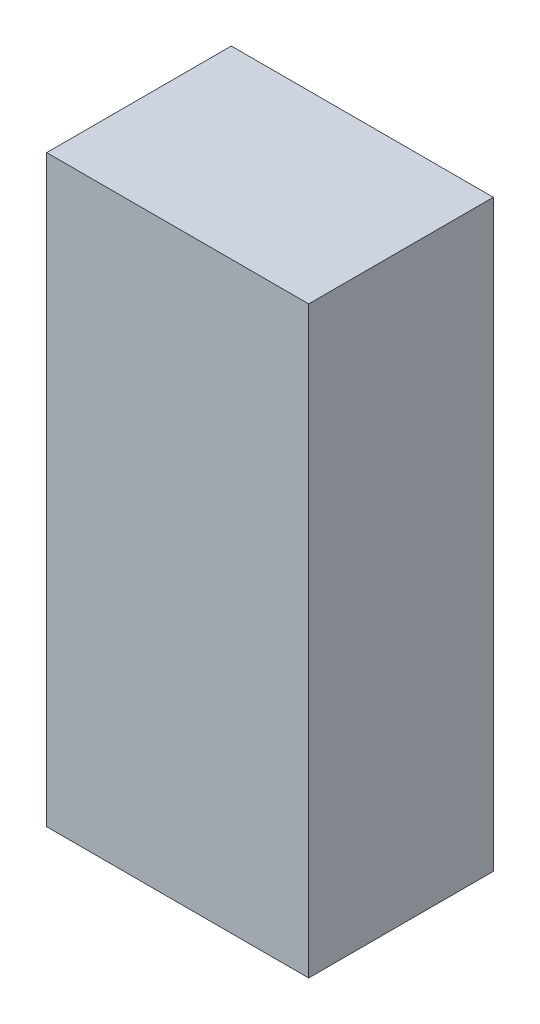
ISO-10303-21;
HEADER;
FILE_DESCRIPTION(('STEP AP214'),'2;1');
FILE_NAME('part.step','',(''),(''),'','','');
FILE_SCHEMA(('AUTOMOTIVE_DESIGN { 1 0 10303 214 1 1 1 1 }'));
ENDSEC;
DATA;
#1=APPLICATION_CONTEXT('core data for automotive mechanical design processes');
#2=APPLICATION_PROTOCOL_DEFINITION('international standard','automotive_design',2000,#1);
#3=PRODUCT_CONTEXT('',#1,'mechanical');
#4=PRODUCT('Part','Part','',(#3));
#5=PRODUCT_RELATED_PRODUCT_CATEGORY('part','',(#4));
#6=PRODUCT_DEFINITION_FORMATION('','',#4);
#7=PRODUCT_DEFINITION_CONTEXT('part definition',#1,'design');
#8=PRODUCT_DEFINITION('design','',#6,#7);
#9=PRODUCT_DEFINITION_SHAPE('','',#8);
#10=(LENGTH_UNIT() NAMED_UNIT(*) SI_UNIT(.MILLI.,.METRE.));
#11=(NAMED_UNIT(*) PLANE_ANGLE_UNIT() SI_UNIT($,.RADIAN.));
#12=(NAMED_UNIT(*) SI_UNIT($,.STERADIAN.) SOLID_ANGLE_UNIT());
#13=UNCERTAINTY_MEASURE_WITH_UNIT(LENGTH_MEASURE(1.E-05),#10,'distance_accuracy_value','');
#14=(GEOMETRIC_REPRESENTATION_CONTEXT(3) GLOBAL_UNCERTAINTY_ASSIGNED_CONTEXT((#13)) GLOBAL_UNIT_ASSIGNED_CONTEXT((#10,
#11,#12)) REPRESENTATION_CONTEXT('',''));
#15=CARTESIAN_POINT('',(0.,0.,0.));
#16=DIRECTION('',(0.,0.,1.));
#17=DIRECTION('',(1.,0.,0.));
#18=AXIS2_PLACEMENT_3D('',#15,#16,#17);
#19=CARTESIAN_POINT('',(0.92000832,-2.05000352,1.29679954));
#20=DIRECTION('',(0.,0.,-1.));
#21=DIRECTION('',(0.,-1.,0.));
#22=AXIS2_PLACEMENT_3D('',#19,#20,#21);
#23=PLANE('',#22);
#24=DIRECTION('',(1.67268005458418E-05,0.999999999860107,0.));
#25=VECTOR('',#24,1.);
#26=CARTESIAN_POINT('',(0.92000832,-2.05000352,1.29679954));
#27=LINE('',#26,#25);
#28=CARTESIAN_POINT('',(0.92000832,-2.05000352,1.29679954));
#29=VERTEX_POINT('',#28);
#30=CARTESIAN_POINT('',(0.9200769,2.05000352,1.29679954));
#31=VERTEX_POINT('',#30);
#32=EDGE_CURVE('E97',#29,#31,#27,.T.);
#33=ORIENTED_EDGE('',*,*,#32,.T.);
#34=DIRECTION('',(-1.,0.,0.));
#35=VECTOR('',#34,1.);
#36=CARTESIAN_POINT('',(0.9200769,2.05000352,1.29679954));
#37=LINE('',#36,#35);
#38=CARTESIAN_POINT('',(-0.92007436,2.05000352,1.29679954));
#39=VERTEX_POINT('',#38);
#40=EDGE_CURVE('E69',#31,#39,#37,.T.);
#41=ORIENTED_EDGE('',*,*,#40,.T.);
#42=DIRECTION('',(0.,-1.,0.));
#43=VECTOR('',#42,1.);
#44=CARTESIAN_POINT('',(-0.92007436,2.05000352,1.29679954));
#45=LINE('',#44,#43);
#46=CARTESIAN_POINT('',(-0.92007436,-2.04997558,1.29679954));
#47=VERTEX_POINT('',#46);
#48=EDGE_CURVE('E84',#39,#47,#45,.T.);
#49=ORIENTED_EDGE('',*,*,#48,.T.);
#50=DIRECTION('',(0.999999999884722,-1.51841003101958E-05,0.));
#51=VECTOR('',#50,1.);
#52=CARTESIAN_POINT('',(-0.92007436,-2.04997558,1.29679954));
#53=LINE('',#52,#51);
#54=EDGE_CURVE('E11',#47,#29,#53,.T.);
#55=ORIENTED_EDGE('',*,*,#54,.T.);
#56=EDGE_LOOP('',(#33,#41,#49,#55));
#57=FACE_BOUND('',#56,.T.);
#58=ADVANCED_FACE('F17',(#57),#23,.F.);
#59=CARTESIAN_POINT('',(0.92000832,-2.05000352,0.));
#60=DIRECTION('',(0.,0.,-1.));
#61=DIRECTION('',(0.,-1.,0.));
#62=AXIS2_PLACEMENT_3D('',#59,#60,#61);
#63=PLANE('',#62);
#64=DIRECTION('',(1.67268005458418E-05,0.999999999860107,0.));
#65=VECTOR('',#64,1.);
#66=CARTESIAN_POINT('',(0.92000832,-2.05000352,0.));
#67=LINE('',#66,#65);
#68=CARTESIAN_POINT('',(0.92000832,-2.05000352,0.));
#69=VERTEX_POINT('',#68);
#70=CARTESIAN_POINT('',(0.9200769,2.05000352,0.));
#71=VERTEX_POINT('',#70);
#72=EDGE_CURVE('E87',#69,#71,#67,.T.);
#73=ORIENTED_EDGE('',*,*,#72,.F.);
#74=DIRECTION('',(0.999999999884722,-1.51841003101958E-05,0.));
#75=VECTOR('',#74,1.);
#76=CARTESIAN_POINT('',(-0.92007436,-2.04997558,0.));
#77=LINE('',#76,#75);
#78=CARTESIAN_POINT('',(-0.92007436,-2.04997558,0.));
#79=VERTEX_POINT('',#78);
#80=EDGE_CURVE('E27',#79,#69,#77,.T.);
#81=ORIENTED_EDGE('',*,*,#80,.F.);
#82=DIRECTION('',(0.,-1.,0.));
#83=VECTOR('',#82,1.);
#84=CARTESIAN_POINT('',(-0.92007436,2.05000352,0.));
#85=LINE('',#84,#83);
#86=CARTESIAN_POINT('',(-0.92007436,2.05000352,0.));
#87=VERTEX_POINT('',#86);
#88=EDGE_CURVE('E56',#87,#79,#85,.T.);
#89=ORIENTED_EDGE('',*,*,#88,.F.);
#90=DIRECTION('',(-1.,0.,0.));
#91=VECTOR('',#90,1.);
#92=CARTESIAN_POINT('',(0.9200769,2.05000352,0.));
#93=LINE('',#92,#91);
#94=EDGE_CURVE('E90',#71,#87,#93,.T.);
#95=ORIENTED_EDGE('',*,*,#94,.F.);
#96=EDGE_LOOP('',(#73,#81,#89,#95));
#97=FACE_BOUND('',#96,.T.);
#98=ADVANCED_FACE('F88',(#97),#63,.T.);
#99=CARTESIAN_POINT('',(-0.92007436,-2.04997558,0.));
#100=DIRECTION('',(1.51841003101958E-05,0.999999999884722,0.));
#101=DIRECTION('',(0.,0.,-1.));
#102=AXIS2_PLACEMENT_3D('',#99,#100,#101);
#103=PLANE('',#102);
#104=DIRECTION('',(0.,0.,1.));
#105=VECTOR('',#104,1.);
#106=CARTESIAN_POINT('',(-0.92007436,-2.04997558,0.));
#107=LINE('',#106,#105);
#108=EDGE_CURVE('E20',#79,#47,#107,.T.);
#109=ORIENTED_EDGE('',*,*,#108,.F.);
#110=ORIENTED_EDGE('',*,*,#80,.T.);
#111=DIRECTION('',(0.,0.,1.));
#112=VECTOR('',#111,1.);
#113=CARTESIAN_POINT('',(0.92000832,-2.05000352,0.));
#114=LINE('',#113,#112);
#115=EDGE_CURVE('E81',#69,#29,#114,.T.);
#116=ORIENTED_EDGE('',*,*,#115,.T.);
#117=ORIENTED_EDGE('',*,*,#54,.F.);
#118=EDGE_LOOP('',(#109,#110,#116,#117));
#119=FACE_BOUND('',#118,.T.);
#120=ADVANCED_FACE('F79',(#119),#103,.F.);
#121=CARTESIAN_POINT('',(-0.92007436,2.05000352,0.));
#122=DIRECTION('',(1.,0.,0.));
#123=DIRECTION('',(0.,1.,0.));
#124=AXIS2_PLACEMENT_3D('',#121,#122,#123);
#125=PLANE('',#124);
#126=DIRECTION('',(0.,0.,1.));
#127=VECTOR('',#126,1.);
#128=CARTESIAN_POINT('',(-0.92007436,2.05000352,0.));
#129=LINE('',#128,#127);
#130=EDGE_CURVE('E109',#87,#39,#129,.T.);
#131=ORIENTED_EDGE('',*,*,#130,.F.);
#132=ORIENTED_EDGE('',*,*,#88,.T.);
#133=ORIENTED_EDGE('',*,*,#108,.T.);
#134=ORIENTED_EDGE('',*,*,#48,.F.);
#135=EDGE_LOOP('',(#131,#132,#133,#134));
#136=FACE_BOUND('',#135,.T.);
#137=ADVANCED_FACE('F121',(#136),#125,.F.);
#138=CARTESIAN_POINT('',(0.9200769,2.05000352,0.));
#139=DIRECTION('',(0.,-1.,0.));
#140=DIRECTION('',(0.,0.,-1.));
#141=AXIS2_PLACEMENT_3D('',#138,#139,#140);
#142=PLANE('',#141);
#143=DIRECTION('',(0.,0.,1.));
#144=VECTOR('',#143,1.);
#145=CARTESIAN_POINT('',(0.9200769,2.05000352,0.));
#146=LINE('',#145,#144);
#147=EDGE_CURVE('E94',#71,#31,#146,.T.);
#148=ORIENTED_EDGE('',*,*,#147,.F.);
#149=ORIENTED_EDGE('',*,*,#94,.T.);
#150=ORIENTED_EDGE('',*,*,#130,.T.);
#151=ORIENTED_EDGE('',*,*,#40,.F.);
#152=EDGE_LOOP('',(#148,#149,#150,#151));
#153=FACE_BOUND('',#152,.T.);
#154=ADVANCED_FACE('F119',(#153),#142,.F.);
#155=CARTESIAN_POINT('',(0.92000832,-2.05000352,0.));
#156=DIRECTION('',(-0.999999999860107,1.67268005458418E-05,0.));
#157=DIRECTION('',(0.,0.,1.));
#158=AXIS2_PLACEMENT_3D('',#155,#156,#157);
#159=PLANE('',#158);
#160=ORIENTED_EDGE('',*,*,#115,.F.);
#161=ORIENTED_EDGE('',*,*,#72,.T.);
#162=ORIENTED_EDGE('',*,*,#147,.T.);
#163=ORIENTED_EDGE('',*,*,#32,.F.);
#164=EDGE_LOOP('',(#160,#161,#162,#163));
#165=FACE_BOUND('',#164,.T.);
#166=ADVANCED_FACE('F96',(#165),#159,.F.);
#167=CLOSED_SHELL('',(#58,#98,#120,#137,#154,#166));
#168=MANIFOLD_SOLID_BREP('B1',#167);
#169=ADVANCED_BREP_SHAPE_REPRESENTATION('',(#18,#168),#14);
#170=SHAPE_DEFINITION_REPRESENTATION(#9,#169);
ENDSEC;
END-ISO-10303-21;
